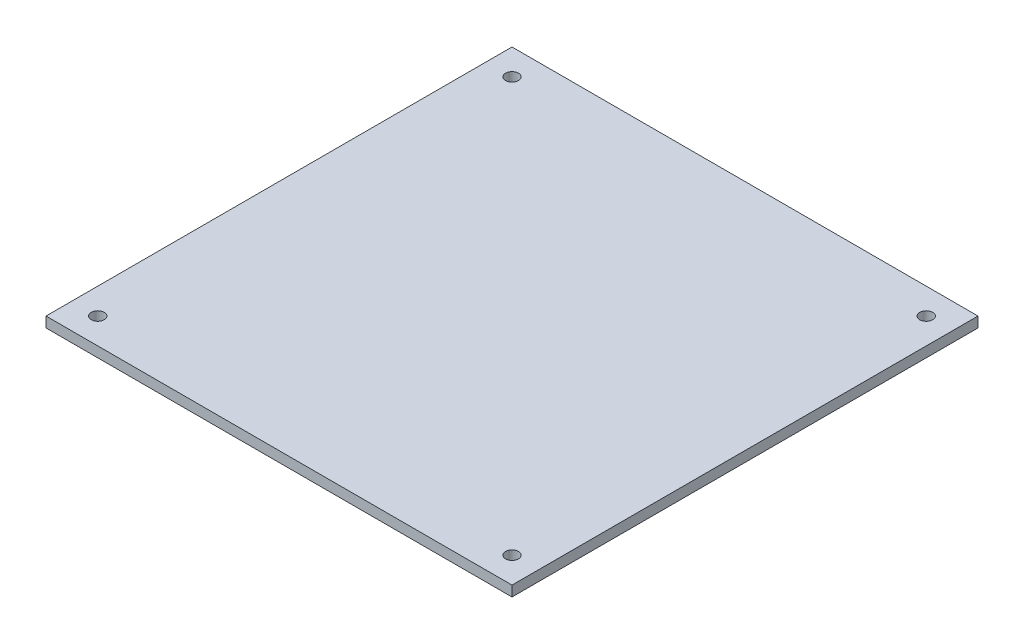
ISO-10303-21;
HEADER;
FILE_DESCRIPTION(('STEP AP214'),'2;1');
FILE_NAME('part.step','',(''),(''),'','','');
FILE_SCHEMA(('AUTOMOTIVE_DESIGN { 1 0 10303 214 1 1 1 1 }'));
ENDSEC;
DATA;
#1=APPLICATION_CONTEXT('core data for automotive mechanical design processes');
#2=APPLICATION_PROTOCOL_DEFINITION('international standard','automotive_design',2000,#1);
#3=PRODUCT_CONTEXT('',#1,'mechanical');
#4=PRODUCT('Part','Part','',(#3));
#5=PRODUCT_RELATED_PRODUCT_CATEGORY('part','',(#4));
#6=PRODUCT_DEFINITION_FORMATION('','',#4);
#7=PRODUCT_DEFINITION_CONTEXT('part definition',#1,'design');
#8=PRODUCT_DEFINITION('design','',#6,#7);
#9=PRODUCT_DEFINITION_SHAPE('','',#8);
#10=(LENGTH_UNIT() NAMED_UNIT(*) SI_UNIT(.MILLI.,.METRE.));
#11=(NAMED_UNIT(*) PLANE_ANGLE_UNIT() SI_UNIT($,.RADIAN.));
#12=(NAMED_UNIT(*) SI_UNIT($,.STERADIAN.) SOLID_ANGLE_UNIT());
#13=UNCERTAINTY_MEASURE_WITH_UNIT(LENGTH_MEASURE(1.E-05),#10,'distance_accuracy_value','');
#14=(GEOMETRIC_REPRESENTATION_CONTEXT(3) GLOBAL_UNCERTAINTY_ASSIGNED_CONTEXT((#13)) GLOBAL_UNIT_ASSIGNED_CONTEXT((#10,
#11,#12)) REPRESENTATION_CONTEXT('',''));
#15=CARTESIAN_POINT('',(0.,0.,0.));
#16=DIRECTION('',(0.,0.,1.));
#17=DIRECTION('',(1.,0.,0.));
#18=AXIS2_PLACEMENT_3D('',#15,#16,#17);
#19=CARTESIAN_POINT('',(45.,2.,45.));
#20=DIRECTION('',(-1.,0.,0.));
#21=DIRECTION('',(0.,0.,1.));
#22=AXIS2_PLACEMENT_3D('',#19,#20,#21);
#23=PLANE('',#22);
#24=DIRECTION('',(0.,0.,-1.));
#25=VECTOR('',#24,1.);
#26=CARTESIAN_POINT('',(45.,0.,45.));
#27=LINE('',#26,#25);
#28=CARTESIAN_POINT('',(45.,0.,45.));
#29=VERTEX_POINT('',#28);
#30=CARTESIAN_POINT('',(45.,0.,-45.));
#31=VERTEX_POINT('',#30);
#32=EDGE_CURVE('E103',#29,#31,#27,.T.);
#33=ORIENTED_EDGE('',*,*,#32,.T.);
#34=DIRECTION('',(0.,-1.,0.));
#35=VECTOR('',#34,1.);
#36=CARTESIAN_POINT('',(45.,2.,-45.));
#37=LINE('',#36,#35);
#38=CARTESIAN_POINT('',(45.,2.,-45.));
#39=VERTEX_POINT('',#38);
#40=EDGE_CURVE('E11',#39,#31,#37,.T.);
#41=ORIENTED_EDGE('',*,*,#40,.F.);
#42=DIRECTION('',(0.,0.,-1.));
#43=VECTOR('',#42,1.);
#44=CARTESIAN_POINT('',(45.,2.,45.));
#45=LINE('',#44,#43);
#46=CARTESIAN_POINT('',(45.,2.,45.));
#47=VERTEX_POINT('',#46);
#48=EDGE_CURVE('E91',#47,#39,#45,.T.);
#49=ORIENTED_EDGE('',*,*,#48,.F.);
#50=DIRECTION('',(0.,-1.,0.));
#51=VECTOR('',#50,1.);
#52=CARTESIAN_POINT('',(45.,2.,45.));
#53=LINE('',#52,#51);
#54=EDGE_CURVE('E99',#47,#29,#53,.T.);
#55=ORIENTED_EDGE('',*,*,#54,.T.);
#56=EDGE_LOOP('',(#33,#41,#49,#55));
#57=FACE_BOUND('',#56,.T.);
#58=ADVANCED_FACE('F40',(#57),#23,.F.);
#59=CARTESIAN_POINT('',(-45.,2.,-45.));
#60=DIRECTION('',(0.,0.,1.));
#61=DIRECTION('',(1.,0.,0.));
#62=AXIS2_PLACEMENT_3D('',#59,#60,#61);
#63=PLANE('',#62);
#64=DIRECTION('',(-1.,0.,0.));
#65=VECTOR('',#64,1.);
#66=CARTESIAN_POINT('',(-45.,0.,-45.));
#67=LINE('',#66,#65);
#68=CARTESIAN_POINT('',(-45.,0.,-45.));
#69=VERTEX_POINT('',#68);
#70=EDGE_CURVE('E95',#31,#69,#67,.T.);
#71=ORIENTED_EDGE('',*,*,#70,.T.);
#72=DIRECTION('',(0.,-1.,0.));
#73=VECTOR('',#72,1.);
#74=CARTESIAN_POINT('',(-45.,2.,-45.));
#75=LINE('',#74,#73);
#76=CARTESIAN_POINT('',(-45.,2.,-45.));
#77=VERTEX_POINT('',#76);
#78=EDGE_CURVE('E48',#77,#69,#75,.T.);
#79=ORIENTED_EDGE('',*,*,#78,.F.);
#80=DIRECTION('',(-1.,0.,0.));
#81=VECTOR('',#80,1.);
#82=CARTESIAN_POINT('',(-45.,2.,-45.));
#83=LINE('',#82,#81);
#84=EDGE_CURVE('E86',#39,#77,#83,.T.);
#85=ORIENTED_EDGE('',*,*,#84,.F.);
#86=ORIENTED_EDGE('',*,*,#40,.T.);
#87=EDGE_LOOP('',(#71,#79,#85,#86));
#88=FACE_BOUND('',#87,.T.);
#89=ADVANCED_FACE('F94',(#88),#63,.F.);
#90=CARTESIAN_POINT('',(-45.,2.,45.));
#91=DIRECTION('',(1.,0.,0.));
#92=DIRECTION('',(0.,0.,-1.));
#93=AXIS2_PLACEMENT_3D('',#90,#91,#92);
#94=PLANE('',#93);
#95=DIRECTION('',(0.,0.,1.));
#96=VECTOR('',#95,1.);
#97=CARTESIAN_POINT('',(-45.,0.,45.));
#98=LINE('',#97,#96);
#99=CARTESIAN_POINT('',(-45.,0.,45.));
#100=VERTEX_POINT('',#99);
#101=EDGE_CURVE('E73',#69,#100,#98,.T.);
#102=ORIENTED_EDGE('',*,*,#101,.T.);
#103=DIRECTION('',(0.,-1.,0.));
#104=VECTOR('',#103,1.);
#105=CARTESIAN_POINT('',(-45.,2.,45.));
#106=LINE('',#105,#104);
#107=CARTESIAN_POINT('',(-45.,2.,45.));
#108=VERTEX_POINT('',#107);
#109=EDGE_CURVE('E96',#108,#100,#106,.T.);
#110=ORIENTED_EDGE('',*,*,#109,.F.);
#111=DIRECTION('',(0.,0.,1.));
#112=VECTOR('',#111,1.);
#113=CARTESIAN_POINT('',(-45.,2.,45.));
#114=LINE('',#113,#112);
#115=EDGE_CURVE('E89',#77,#108,#114,.T.);
#116=ORIENTED_EDGE('',*,*,#115,.F.);
#117=ORIENTED_EDGE('',*,*,#78,.T.);
#118=EDGE_LOOP('',(#102,#110,#116,#117));
#119=FACE_BOUND('',#118,.T.);
#120=ADVANCED_FACE('F97',(#119),#94,.F.);
#121=CARTESIAN_POINT('',(-45.,2.,45.));
#122=DIRECTION('',(0.,0.,-1.));
#123=DIRECTION('',(-1.,0.,0.));
#124=AXIS2_PLACEMENT_3D('',#121,#122,#123);
#125=PLANE('',#124);
#126=DIRECTION('',(1.,0.,0.));
#127=VECTOR('',#126,1.);
#128=CARTESIAN_POINT('',(-45.,0.,45.));
#129=LINE('',#128,#127);
#130=EDGE_CURVE('E79',#100,#29,#129,.T.);
#131=ORIENTED_EDGE('',*,*,#130,.T.);
#132=ORIENTED_EDGE('',*,*,#54,.F.);
#133=DIRECTION('',(1.,0.,0.));
#134=VECTOR('',#133,1.);
#135=CARTESIAN_POINT('',(-45.,2.,45.));
#136=LINE('',#135,#134);
#137=EDGE_CURVE('E56',#108,#47,#136,.T.);
#138=ORIENTED_EDGE('',*,*,#137,.F.);
#139=ORIENTED_EDGE('',*,*,#109,.T.);
#140=EDGE_LOOP('',(#131,#132,#138,#139));
#141=FACE_BOUND('',#140,.T.);
#142=ADVANCED_FACE('F111',(#141),#125,.F.);
#143=CARTESIAN_POINT('',(0.,2.,0.));
#144=DIRECTION('',(0.,-1.,0.));
#145=DIRECTION('',(0.,0.,-1.));
#146=AXIS2_PLACEMENT_3D('',#143,#144,#145);
#147=PLANE('',#146);
#148=CARTESIAN_POINT('',(-40.,2.,-40.));
#149=DIRECTION('',(0.,1.,0.));
#150=DIRECTION('',(0.,0.,1.));
#151=AXIS2_PLACEMENT_3D('',#148,#149,#150);
#152=CIRCLE('',#151,1.24999999999999);
#153=CARTESIAN_POINT('',(-40.,2.,-38.75));
#154=VERTEX_POINT('',#153);
#155=EDGE_CURVE('E137',#154,#154,#152,.T.);
#156=ORIENTED_EDGE('',*,*,#155,.F.);
#157=EDGE_LOOP('',(#156));
#158=FACE_BOUND('',#157,.T.);
#159=CARTESIAN_POINT('',(40.,2.,-40.));
#160=DIRECTION('',(0.,1.,0.));
#161=DIRECTION('',(0.,0.,1.));
#162=AXIS2_PLACEMENT_3D('',#159,#160,#161);
#163=CIRCLE('',#162,1.24999999999999);
#164=CARTESIAN_POINT('',(40.,2.,-38.75));
#165=VERTEX_POINT('',#164);
#166=EDGE_CURVE('E131',#165,#165,#163,.T.);
#167=ORIENTED_EDGE('',*,*,#166,.F.);
#168=EDGE_LOOP('',(#167));
#169=FACE_BOUND('',#168,.T.);
#170=CARTESIAN_POINT('',(40.,2.,40.));
#171=DIRECTION('',(0.,1.,0.));
#172=DIRECTION('',(0.,0.,1.));
#173=AXIS2_PLACEMENT_3D('',#170,#171,#172);
#174=CIRCLE('',#173,1.24999999999999);
#175=CARTESIAN_POINT('',(40.,2.,41.25));
#176=VERTEX_POINT('',#175);
#177=EDGE_CURVE('E125',#176,#176,#174,.T.);
#178=ORIENTED_EDGE('',*,*,#177,.F.);
#179=EDGE_LOOP('',(#178));
#180=FACE_BOUND('',#179,.T.);
#181=CARTESIAN_POINT('',(-40.,2.,40.));
#182=DIRECTION('',(0.,1.,0.));
#183=DIRECTION('',(0.,0.,1.));
#184=AXIS2_PLACEMENT_3D('',#181,#182,#183);
#185=CIRCLE('',#184,1.24999999999999);
#186=CARTESIAN_POINT('',(-40.,2.,41.25));
#187=VERTEX_POINT('',#186);
#188=EDGE_CURVE('E119',#187,#187,#185,.T.);
#189=ORIENTED_EDGE('',*,*,#188,.F.);
#190=EDGE_LOOP('',(#189));
#191=FACE_BOUND('',#190,.T.);
#192=ORIENTED_EDGE('',*,*,#48,.T.);
#193=ORIENTED_EDGE('',*,*,#84,.T.);
#194=ORIENTED_EDGE('',*,*,#115,.T.);
#195=ORIENTED_EDGE('',*,*,#137,.T.);
#196=EDGE_LOOP('',(#192,#193,#194,#195));
#197=FACE_BOUND('',#196,.T.);
#198=ADVANCED_FACE('F87',(#158,#169,#180,#191,#197),#147,.F.);
#199=CARTESIAN_POINT('',(0.,0.,0.));
#200=DIRECTION('',(0.,-1.,0.));
#201=DIRECTION('',(0.,0.,-1.));
#202=AXIS2_PLACEMENT_3D('',#199,#200,#201);
#203=PLANE('',#202);
#204=CARTESIAN_POINT('',(-40.,0.,-40.));
#205=DIRECTION('',(0.,1.,0.));
#206=DIRECTION('',(0.,0.,1.));
#207=AXIS2_PLACEMENT_3D('',#204,#205,#206);
#208=CIRCLE('',#207,1.25);
#209=CARTESIAN_POINT('',(-40.,0.,-38.75));
#210=VERTEX_POINT('',#209);
#211=EDGE_CURVE('E134',#210,#210,#208,.T.);
#212=ORIENTED_EDGE('',*,*,#211,.T.);
#213=EDGE_LOOP('',(#212));
#214=FACE_BOUND('',#213,.T.);
#215=CARTESIAN_POINT('',(40.,0.,-40.));
#216=DIRECTION('',(0.,1.,0.));
#217=DIRECTION('',(0.,0.,1.));
#218=AXIS2_PLACEMENT_3D('',#215,#216,#217);
#219=CIRCLE('',#218,1.25);
#220=CARTESIAN_POINT('',(40.,0.,-38.75));
#221=VERTEX_POINT('',#220);
#222=EDGE_CURVE('E128',#221,#221,#219,.T.);
#223=ORIENTED_EDGE('',*,*,#222,.T.);
#224=EDGE_LOOP('',(#223));
#225=FACE_BOUND('',#224,.T.);
#226=CARTESIAN_POINT('',(40.,0.,40.));
#227=DIRECTION('',(0.,1.,0.));
#228=DIRECTION('',(0.,0.,1.));
#229=AXIS2_PLACEMENT_3D('',#226,#227,#228);
#230=CIRCLE('',#229,1.25);
#231=CARTESIAN_POINT('',(40.,0.,41.25));
#232=VERTEX_POINT('',#231);
#233=EDGE_CURVE('E122',#232,#232,#230,.T.);
#234=ORIENTED_EDGE('',*,*,#233,.T.);
#235=EDGE_LOOP('',(#234));
#236=FACE_BOUND('',#235,.T.);
#237=CARTESIAN_POINT('',(-40.,0.,40.));
#238=DIRECTION('',(0.,1.,0.));
#239=DIRECTION('',(0.,0.,1.));
#240=AXIS2_PLACEMENT_3D('',#237,#238,#239);
#241=CIRCLE('',#240,1.25);
#242=CARTESIAN_POINT('',(-40.,0.,41.25));
#243=VERTEX_POINT('',#242);
#244=EDGE_CURVE('E106',#243,#243,#241,.T.);
#245=ORIENTED_EDGE('',*,*,#244,.T.);
#246=EDGE_LOOP('',(#245));
#247=FACE_BOUND('',#246,.T.);
#248=ORIENTED_EDGE('',*,*,#32,.F.);
#249=ORIENTED_EDGE('',*,*,#130,.F.);
#250=ORIENTED_EDGE('',*,*,#101,.F.);
#251=ORIENTED_EDGE('',*,*,#70,.F.);
#252=EDGE_LOOP('',(#248,#249,#250,#251));
#253=FACE_BOUND('',#252,.T.);
#254=ADVANCED_FACE('F114',(#214,#225,#236,#247,#253),#203,.T.);
#255=CARTESIAN_POINT('',(-40.,2.,40.));
#256=DIRECTION('',(0.,1.,0.));
#257=DIRECTION('',(0.,0.,1.));
#258=AXIS2_PLACEMENT_3D('',#255,#256,#257);
#259=CYLINDRICAL_SURFACE('',#258,1.24999999999999);
#260=ORIENTED_EDGE('',*,*,#244,.F.);
#261=EDGE_LOOP('',(#260));
#262=FACE_BOUND('',#261,.T.);
#263=ORIENTED_EDGE('',*,*,#188,.T.);
#264=EDGE_LOOP('',(#263));
#265=FACE_BOUND('',#264,.T.);
#266=ADVANCED_FACE('F152',(#262,#265),#259,.F.);
#267=CARTESIAN_POINT('',(40.,2.,40.));
#268=DIRECTION('',(0.,1.,0.));
#269=DIRECTION('',(0.,0.,1.));
#270=AXIS2_PLACEMENT_3D('',#267,#268,#269);
#271=CYLINDRICAL_SURFACE('',#270,1.24999999999999);
#272=ORIENTED_EDGE('',*,*,#233,.F.);
#273=EDGE_LOOP('',(#272));
#274=FACE_BOUND('',#273,.T.);
#275=ORIENTED_EDGE('',*,*,#177,.T.);
#276=EDGE_LOOP('',(#275));
#277=FACE_BOUND('',#276,.T.);
#278=ADVANCED_FACE('F154',(#274,#277),#271,.F.);
#279=CARTESIAN_POINT('',(40.,2.,-40.));
#280=DIRECTION('',(0.,1.,0.));
#281=DIRECTION('',(0.,0.,1.));
#282=AXIS2_PLACEMENT_3D('',#279,#280,#281);
#283=CYLINDRICAL_SURFACE('',#282,1.24999999999999);
#284=ORIENTED_EDGE('',*,*,#222,.F.);
#285=EDGE_LOOP('',(#284));
#286=FACE_BOUND('',#285,.T.);
#287=ORIENTED_EDGE('',*,*,#166,.T.);
#288=EDGE_LOOP('',(#287));
#289=FACE_BOUND('',#288,.T.);
#290=ADVANCED_FACE('F161',(#286,#289),#283,.F.);
#291=CARTESIAN_POINT('',(-40.,2.,-40.));
#292=DIRECTION('',(0.,1.,0.));
#293=DIRECTION('',(0.,0.,1.));
#294=AXIS2_PLACEMENT_3D('',#291,#292,#293);
#295=CYLINDRICAL_SURFACE('',#294,1.24999999999999);
#296=ORIENTED_EDGE('',*,*,#211,.F.);
#297=EDGE_LOOP('',(#296));
#298=FACE_BOUND('',#297,.T.);
#299=ORIENTED_EDGE('',*,*,#155,.T.);
#300=EDGE_LOOP('',(#299));
#301=FACE_BOUND('',#300,.T.);
#302=ADVANCED_FACE('F141',(#298,#301),#295,.F.);
#303=CLOSED_SHELL('',(#58,#89,#120,#142,#198,#254,#266,#278,#290,#302));
#304=MANIFOLD_SOLID_BREP('B2',#303);
#305=ADVANCED_BREP_SHAPE_REPRESENTATION('',(#18,#304),#14);
#306=SHAPE_DEFINITION_REPRESENTATION(#9,#305);
ENDSEC;
END-ISO-10303-21;
